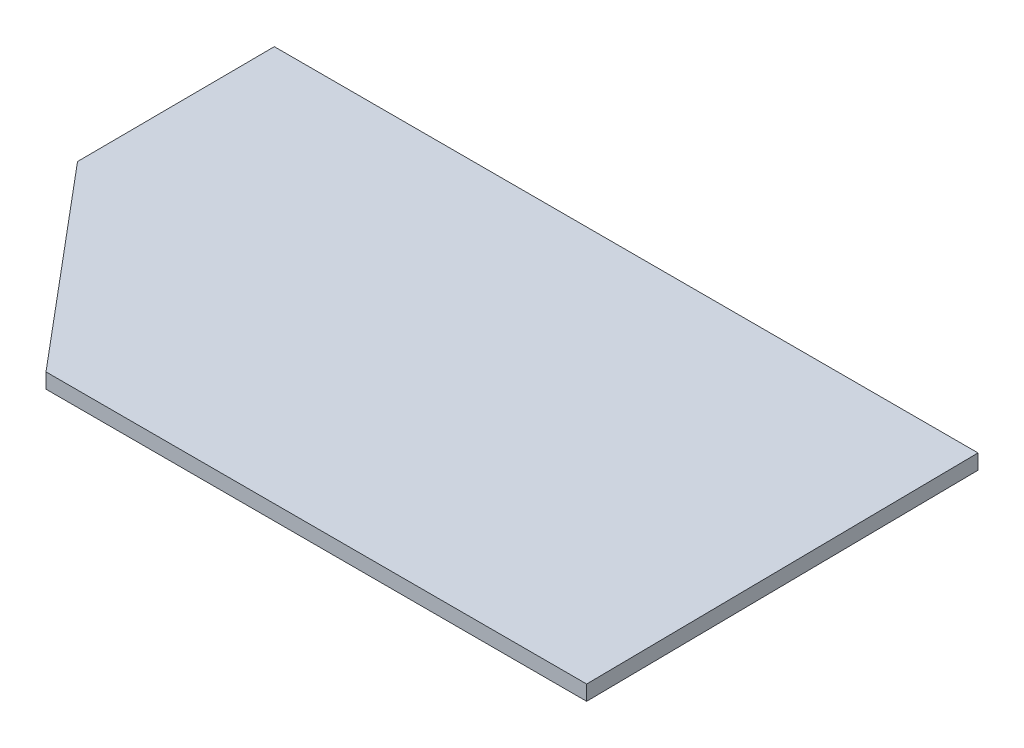
ISO-10303-21;
HEADER;
FILE_DESCRIPTION(('STEP AP214'),'2;1');
FILE_NAME('part.step','',(''),(''),'','','');
FILE_SCHEMA(('AUTOMOTIVE_DESIGN { 1 0 10303 214 1 1 1 1 }'));
ENDSEC;
DATA;
#1=APPLICATION_CONTEXT('core data for automotive mechanical design processes');
#2=APPLICATION_PROTOCOL_DEFINITION('international standard','automotive_design',2000,#1);
#3=PRODUCT_CONTEXT('',#1,'mechanical');
#4=PRODUCT('Part','Part','',(#3));
#5=PRODUCT_RELATED_PRODUCT_CATEGORY('part','',(#4));
#6=PRODUCT_DEFINITION_FORMATION('','',#4);
#7=PRODUCT_DEFINITION_CONTEXT('part definition',#1,'design');
#8=PRODUCT_DEFINITION('design','',#6,#7);
#9=PRODUCT_DEFINITION_SHAPE('','',#8);
#10=(LENGTH_UNIT() NAMED_UNIT(*) SI_UNIT(.MILLI.,.METRE.));
#11=(NAMED_UNIT(*) PLANE_ANGLE_UNIT() SI_UNIT($,.RADIAN.));
#12=(NAMED_UNIT(*) SI_UNIT($,.STERADIAN.) SOLID_ANGLE_UNIT());
#13=UNCERTAINTY_MEASURE_WITH_UNIT(LENGTH_MEASURE(1.E-05),#10,'distance_accuracy_value','');
#14=(GEOMETRIC_REPRESENTATION_CONTEXT(3) GLOBAL_UNCERTAINTY_ASSIGNED_CONTEXT((#13)) GLOBAL_UNIT_ASSIGNED_CONTEXT((#10,
#11,#12)) REPRESENTATION_CONTEXT('',''));
#15=CARTESIAN_POINT('',(0.,0.,0.));
#16=DIRECTION('',(0.,0.,1.));
#17=DIRECTION('',(1.,0.,0.));
#18=AXIS2_PLACEMENT_3D('',#15,#16,#17);
#19=CARTESIAN_POINT('',(-22.3081625310126,2.,-52.7235029574443));
#20=DIRECTION('',(0.999984853575955,0.,-0.00550387306146126));
#21=DIRECTION('',(-0.00550387306146126,0.,-0.999984853575955));
#22=AXIS2_PLACEMENT_3D('',#19,#20,#21);
#23=PLANE('',#22);
#24=DIRECTION('',(0.00550387306146126,0.,0.999984853575955));
#25=VECTOR('',#24,1.);
#26=CARTESIAN_POINT('',(-22.3081625310126,0.,-52.7235029574443));
#27=LINE('',#26,#25);
#28=CARTESIAN_POINT('',(-22.3081625310126,0.,-52.7235029574443));
#29=VERTEX_POINT('',#28);
#30=CARTESIAN_POINT('',(-22.1630685995418,0.,-26.3617514787226));
#31=VERTEX_POINT('',#30);
#32=EDGE_CURVE('E118',#29,#31,#27,.T.);
#33=ORIENTED_EDGE('',*,*,#32,.T.);
#34=DIRECTION('',(0.,-1.,0.));
#35=VECTOR('',#34,1.);
#36=CARTESIAN_POINT('',(-22.1630685995418,2.,-26.3617514787226));
#37=LINE('',#36,#35);
#38=CARTESIAN_POINT('',(-22.1630685995418,2.,-26.3617514787226));
#39=VERTEX_POINT('',#38);
#40=EDGE_CURVE('E11',#39,#31,#37,.T.);
#41=ORIENTED_EDGE('',*,*,#40,.F.);
#42=DIRECTION('',(0.00550387306146126,0.,0.999984853575955));
#43=VECTOR('',#42,1.);
#44=CARTESIAN_POINT('',(-22.3081625310126,2.,-52.7235029574443));
#45=LINE('',#44,#43);
#46=CARTESIAN_POINT('',(-22.3081625310126,2.,-52.7235029574443));
#47=VERTEX_POINT('',#46);
#48=EDGE_CURVE('E131',#47,#39,#45,.T.);
#49=ORIENTED_EDGE('',*,*,#48,.F.);
#50=DIRECTION('',(0.,-1.,0.));
#51=VECTOR('',#50,1.);
#52=CARTESIAN_POINT('',(-22.3081625310126,2.,-52.7235029574443));
#53=LINE('',#52,#51);
#54=EDGE_CURVE('E114',#47,#29,#53,.T.);
#55=ORIENTED_EDGE('',*,*,#54,.T.);
#56=EDGE_LOOP('',(#33,#41,#49,#55));
#57=FACE_BOUND('',#56,.T.);
#58=ADVANCED_FACE('F39',(#57),#23,.F.);
#59=CARTESIAN_POINT('',(-22.1630685995418,2.,-26.3617514787226));
#60=DIRECTION('',(0.765430274456859,0.,-0.643518838065287));
#61=DIRECTION('',(-0.643518838065287,0.,-0.765430274456859));
#62=AXIS2_PLACEMENT_3D('',#59,#60,#61);
#63=PLANE('',#62);
#64=DIRECTION('',(0.643518838065287,0.,0.765430274456859));
#65=VECTOR('',#64,1.);
#66=CARTESIAN_POINT('',(-22.1630685995418,0.,-26.3617514787226));
#67=LINE('',#66,#65);
#68=CARTESIAN_POINT('',(0.,0.,0.));
#69=VERTEX_POINT('',#68);
#70=EDGE_CURVE('E122',#31,#69,#67,.T.);
#71=ORIENTED_EDGE('',*,*,#70,.T.);
#72=DIRECTION('',(0.,-1.,0.));
#73=VECTOR('',#72,1.);
#74=CARTESIAN_POINT('',(0.,2.,0.));
#75=LINE('',#74,#73);
#76=CARTESIAN_POINT('',(0.,2.,0.));
#77=VERTEX_POINT('',#76);
#78=EDGE_CURVE('E48',#77,#69,#75,.T.);
#79=ORIENTED_EDGE('',*,*,#78,.F.);
#80=DIRECTION('',(0.643518838065287,0.,0.765430274456859));
#81=VECTOR('',#80,1.);
#82=CARTESIAN_POINT('',(-22.1630685995418,2.,-26.3617514787226));
#83=LINE('',#82,#81);
#84=EDGE_CURVE('E90',#39,#77,#83,.T.);
#85=ORIENTED_EDGE('',*,*,#84,.F.);
#86=ORIENTED_EDGE('',*,*,#40,.T.);
#87=EDGE_LOOP('',(#71,#79,#85,#86));
#88=FACE_BOUND('',#87,.T.);
#89=ADVANCED_FACE('F153',(#88),#63,.F.);
#90=CARTESIAN_POINT('',(0.,2.,0.));
#91=DIRECTION('',(0.,0.,-1.));
#92=DIRECTION('',(-1.,0.,0.));
#93=AXIS2_PLACEMENT_3D('',#90,#91,#92);
#94=PLANE('',#93);
#95=DIRECTION('',(1.,0.,0.));
#96=VECTOR('',#95,1.);
#97=CARTESIAN_POINT('',(0.,0.,0.));
#98=LINE('',#97,#96);
#99=CARTESIAN_POINT('',(72.0179746680702,0.,0.));
#100=VERTEX_POINT('',#99);
#101=EDGE_CURVE('E106',#69,#100,#98,.T.);
#102=ORIENTED_EDGE('',*,*,#101,.T.);
#103=DIRECTION('',(0.,-1.,0.));
#104=VECTOR('',#103,1.);
#105=CARTESIAN_POINT('',(72.0179746680702,2.,0.));
#106=LINE('',#105,#104);
#107=CARTESIAN_POINT('',(72.0179746680702,2.,0.));
#108=VERTEX_POINT('',#107);
#109=EDGE_CURVE('E103',#108,#100,#106,.T.);
#110=ORIENTED_EDGE('',*,*,#109,.F.);
#111=DIRECTION('',(1.,0.,0.));
#112=VECTOR('',#111,1.);
#113=CARTESIAN_POINT('',(0.,2.,0.));
#114=LINE('',#113,#112);
#115=EDGE_CURVE('E94',#77,#108,#114,.T.);
#116=ORIENTED_EDGE('',*,*,#115,.F.);
#117=ORIENTED_EDGE('',*,*,#78,.T.);
#118=EDGE_LOOP('',(#102,#110,#116,#117));
#119=FACE_BOUND('',#118,.T.);
#120=ADVANCED_FACE('F104',(#119),#94,.F.);
#121=CARTESIAN_POINT('',(72.0179746680702,2.,0.));
#122=DIRECTION('',(-0.999936038963642,0.,0.0113100831871857));
#123=DIRECTION('',(0.0113100831871857,0.,0.999936038963642));
#124=AXIS2_PLACEMENT_3D('',#121,#122,#123);
#125=PLANE('',#124);
#126=DIRECTION('',(-0.0113100831871857,0.,-0.999936038963642));
#127=VECTOR('',#126,1.);
#128=CARTESIAN_POINT('',(72.0179746680702,0.,0.));
#129=LINE('',#128,#127);
#130=CARTESIAN_POINT('',(71.4216293208352,0.,-52.7235029574443));
#131=VERTEX_POINT('',#130);
#132=EDGE_CURVE('E76',#100,#131,#129,.T.);
#133=ORIENTED_EDGE('',*,*,#132,.T.);
#134=DIRECTION('',(0.,-1.,0.));
#135=VECTOR('',#134,1.);
#136=CARTESIAN_POINT('',(71.4216293208352,2.,-52.7235029574443));
#137=LINE('',#136,#135);
#138=CARTESIAN_POINT('',(71.4216293208352,2.,-52.7235029574443));
#139=VERTEX_POINT('',#138);
#140=EDGE_CURVE('E108',#139,#131,#137,.T.);
#141=ORIENTED_EDGE('',*,*,#140,.F.);
#142=DIRECTION('',(-0.0113100831871857,0.,-0.999936038963642));
#143=VECTOR('',#142,1.);
#144=CARTESIAN_POINT('',(72.0179746680702,2.,0.));
#145=LINE('',#144,#143);
#146=EDGE_CURVE('E98',#108,#139,#145,.T.);
#147=ORIENTED_EDGE('',*,*,#146,.F.);
#148=ORIENTED_EDGE('',*,*,#109,.T.);
#149=EDGE_LOOP('',(#133,#141,#147,#148));
#150=FACE_BOUND('',#149,.T.);
#151=ADVANCED_FACE('F110',(#150),#125,.F.);
#152=CARTESIAN_POINT('',(71.4216293208352,2.,-52.7235029574443));
#153=DIRECTION('',(0.,0.,1.));
#154=DIRECTION('',(1.,0.,0.));
#155=AXIS2_PLACEMENT_3D('',#152,#153,#154);
#156=PLANE('',#155);
#157=DIRECTION('',(-1.,0.,0.));
#158=VECTOR('',#157,1.);
#159=CARTESIAN_POINT('',(71.4216293208352,0.,-52.7235029574443));
#160=LINE('',#159,#158);
#161=EDGE_CURVE('E82',#131,#29,#160,.T.);
#162=ORIENTED_EDGE('',*,*,#161,.T.);
#163=ORIENTED_EDGE('',*,*,#54,.F.);
#164=DIRECTION('',(-1.,0.,0.));
#165=VECTOR('',#164,1.);
#166=CARTESIAN_POINT('',(71.4216293208352,2.,-52.7235029574443));
#167=LINE('',#166,#165);
#168=EDGE_CURVE('E56',#139,#47,#167,.T.);
#169=ORIENTED_EDGE('',*,*,#168,.F.);
#170=ORIENTED_EDGE('',*,*,#140,.T.);
#171=EDGE_LOOP('',(#162,#163,#169,#170));
#172=FACE_BOUND('',#171,.T.);
#173=ADVANCED_FACE('F142',(#172),#156,.F.);
#174=CARTESIAN_POINT('',(0.,2.,0.));
#175=DIRECTION('',(0.,1.,0.));
#176=DIRECTION('',(0.,0.,1.));
#177=AXIS2_PLACEMENT_3D('',#174,#175,#176);
#178=PLANE('',#177);
#179=ORIENTED_EDGE('',*,*,#48,.T.);
#180=ORIENTED_EDGE('',*,*,#84,.T.);
#181=ORIENTED_EDGE('',*,*,#115,.T.);
#182=ORIENTED_EDGE('',*,*,#146,.T.);
#183=ORIENTED_EDGE('',*,*,#168,.T.);
#184=EDGE_LOOP('',(#179,#180,#181,#182,#183));
#185=FACE_BOUND('',#184,.T.);
#186=ADVANCED_FACE('F96',(#185),#178,.T.);
#187=CARTESIAN_POINT('',(0.,0.,0.));
#188=DIRECTION('',(0.,1.,0.));
#189=DIRECTION('',(0.,0.,1.));
#190=AXIS2_PLACEMENT_3D('',#187,#188,#189);
#191=PLANE('',#190);
#192=ORIENTED_EDGE('',*,*,#32,.F.);
#193=ORIENTED_EDGE('',*,*,#161,.F.);
#194=ORIENTED_EDGE('',*,*,#132,.F.);
#195=ORIENTED_EDGE('',*,*,#101,.F.);
#196=ORIENTED_EDGE('',*,*,#70,.F.);
#197=EDGE_LOOP('',(#192,#193,#194,#195,#196));
#198=FACE_BOUND('',#197,.T.);
#199=ADVANCED_FACE('F138',(#198),#191,.F.);
#200=CLOSED_SHELL('',(#58,#89,#120,#151,#173,#186,#199));
#201=MANIFOLD_SOLID_BREP('B2',#200);
#202=ADVANCED_BREP_SHAPE_REPRESENTATION('',(#18,#201),#14);
#203=SHAPE_DEFINITION_REPRESENTATION(#9,#202);
ENDSEC;
END-ISO-10303-21;
